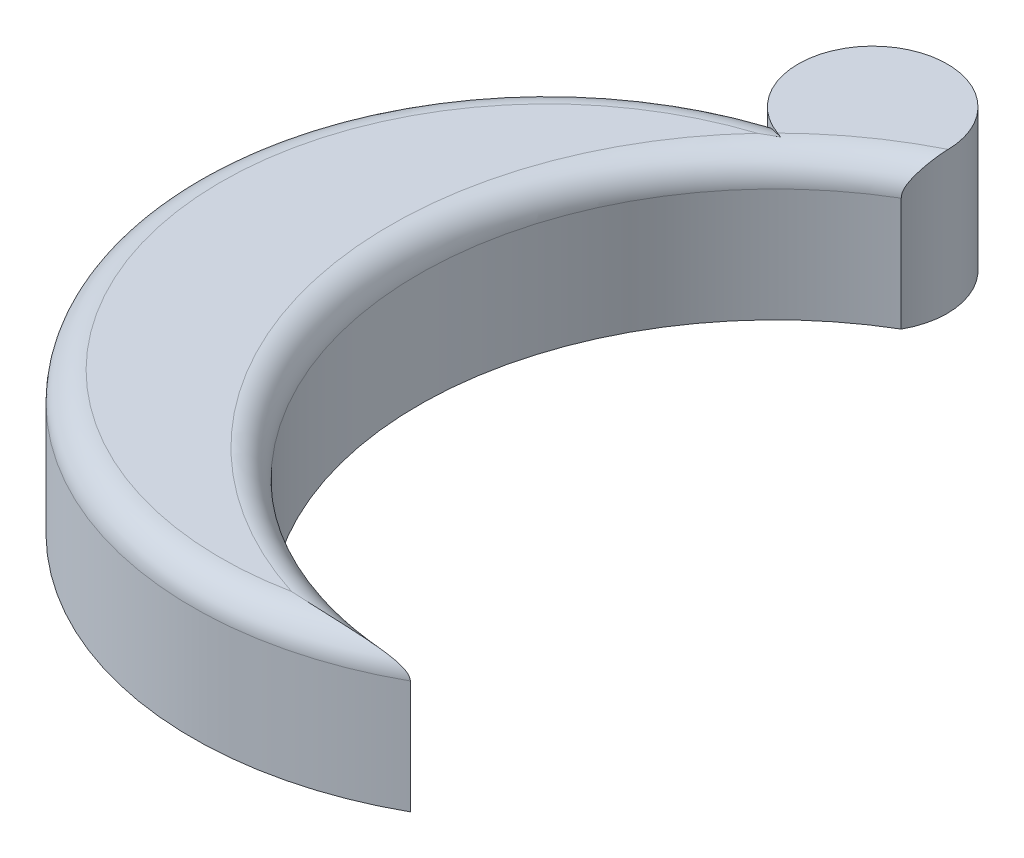
ISO-10303-21;
HEADER;
FILE_DESCRIPTION(('STEP AP214'),'2;1');
FILE_NAME('part.step','',(''),(''),'','','');
FILE_SCHEMA(('AUTOMOTIVE_DESIGN { 1 0 10303 214 1 1 1 1 }'));
ENDSEC;
DATA;
#1=APPLICATION_CONTEXT('core data for automotive mechanical design processes');
#2=APPLICATION_PROTOCOL_DEFINITION('international standard','automotive_design',2000,#1);
#3=PRODUCT_CONTEXT('',#1,'mechanical');
#4=PRODUCT('Part','Part','',(#3));
#5=PRODUCT_RELATED_PRODUCT_CATEGORY('part','',(#4));
#6=PRODUCT_DEFINITION_FORMATION('','',#4);
#7=PRODUCT_DEFINITION_CONTEXT('part definition',#1,'design');
#8=PRODUCT_DEFINITION('design','',#6,#7);
#9=PRODUCT_DEFINITION_SHAPE('','',#8);
#10=(LENGTH_UNIT() NAMED_UNIT(*) SI_UNIT(.MILLI.,.METRE.));
#11=(NAMED_UNIT(*) PLANE_ANGLE_UNIT() SI_UNIT($,.RADIAN.));
#12=(NAMED_UNIT(*) SI_UNIT($,.STERADIAN.) SOLID_ANGLE_UNIT());
#13=UNCERTAINTY_MEASURE_WITH_UNIT(LENGTH_MEASURE(1.E-05),#10,'distance_accuracy_value','');
#14=(GEOMETRIC_REPRESENTATION_CONTEXT(3) GLOBAL_UNCERTAINTY_ASSIGNED_CONTEXT((#13)) GLOBAL_UNIT_ASSIGNED_CONTEXT((#10,
#11,#12)) REPRESENTATION_CONTEXT('',''));
#15=CARTESIAN_POINT('',(0.,0.,0.));
#16=DIRECTION('',(0.,0.,1.));
#17=DIRECTION('',(1.,0.,0.));
#18=AXIS2_PLACEMENT_3D('',#15,#16,#17);
#19=CARTESIAN_POINT('',(-59.5639231366178,4.,-10.628423661122));
#20=DIRECTION('',(0.,1.,0.));
#21=DIRECTION('',(0.,0.,1.));
#22=AXIS2_PLACEMENT_3D('',#19,#20,#21);
#23=PLANE('',#22);
#24=CARTESIAN_POINT('',(-53.5339748169812,4.,-6.44449250465161));
#25=DIRECTION('',(0.,1.,0.));
#26=DIRECTION('',(0.,0.,1.));
#27=AXIS2_PLACEMENT_3D('',#24,#25,#26);
#28=CIRCLE('',#27,10.8650714686804);
#29=CARTESIAN_POINT('',(-56.8376783001658,4.,3.90612686400102));
#30=VERTEX_POINT('',#29);
#31=CARTESIAN_POINT('',(-61.4633027143419,4.,-13.8725162738429));
#32=VERTEX_POINT('',#31);
#33=EDGE_CURVE('E118',#30,#32,#28,.F.);
#34=ORIENTED_EDGE('',*,*,#33,.T.);
#35=CARTESIAN_POINT('',(-58.6468152214102,4.,-5.11424029039963));
#36=DIRECTION('',(0.,1.,0.));
#37=DIRECTION('',(0.,0.,1.));
#38=AXIS2_PLACEMENT_3D('',#35,#36,#37);
#39=CIRCLE('',#38,9.2);
#40=EDGE_CURVE('E120',#32,#30,#39,.T.);
#41=ORIENTED_EDGE('',*,*,#40,.T.);
#42=EDGE_LOOP('',(#34,#41));
#43=FACE_BOUND('',#42,.T.);
#44=ADVANCED_FACE('F33',(#43),#23,.T.);
#45=CARTESIAN_POINT('',(-60.4810310518254,4.,-16.1426070318443));
#46=DIRECTION('',(0.,-1.,0.));
#47=DIRECTION('',(0.,0.,-1.));
#48=AXIS2_PLACEMENT_3D('',#45,#46,#47);
#49=CYLINDRICAL_SURFACE('',#48,2.10282806416867);
#50=CARTESIAN_POINT('',(-60.4810310518254,4.,-16.1426070318443));
#51=DIRECTION('',(0.,1.,0.));
#52=DIRECTION('',(0.,0.,1.));
#53=AXIS2_PLACEMENT_3D('',#50,#51,#52);
#54=CIRCLE('',#53,2.10282806416867);
#55=CARTESIAN_POINT('',(-58.378378768013,4.,-16.1697960155329));
#56=VERTEX_POINT('',#55);
#57=CARTESIAN_POINT('',(-61.1833317311835,4.,-14.1605223658352));
#58=VERTEX_POINT('',#57);
#59=EDGE_CURVE('E112',#56,#58,#54,.T.);
#60=ORIENTED_EDGE('',*,*,#59,.F.);
#61=CARTESIAN_POINT('',(-58.378378768013,4.,-16.1697960155329));
#62=CARTESIAN_POINT('',(-58.3780014692178,3.9999999465474,-16.1408949912779));
#63=CARTESIAN_POINT('',(-58.3782279265322,3.99872907116534,-16.1120127621585));
#64=CARTESIAN_POINT('',(-58.3798530227261,3.99382547867741,-16.0545171315933));
#65=CARTESIAN_POINT('',(-58.3812501801303,3.99019574791303,-16.0259034365819));
#66=CARTESIAN_POINT('',(-58.3871072617975,3.97612464313053,-15.9412578059451));
#67=CARTESIAN_POINT('',(-58.3932270001599,3.96249397665374,-15.8858483272136));
#68=CARTESIAN_POINT('',(-58.4092954012554,3.92811462909885,-15.7782595235477));
#69=CARTESIAN_POINT('',(-58.4192250419721,3.90740136493314,-15.7260656229682));
#70=CARTESIAN_POINT('',(-58.4422186007069,3.85972695523316,-15.6250864497154));
#71=CARTESIAN_POINT('',(-58.4552969117372,3.83273713858387,-15.5763181983939));
#72=CARTESIAN_POINT('',(-58.486801596019,3.76666246275849,-15.4729593126887));
#73=CARTESIAN_POINT('',(-58.5057730795343,3.72622447708835,-15.4193807076192));
#74=CARTESIAN_POINT('',(-58.5350711222372,3.65930836951772,-15.3452123200485));
#75=CARTESIAN_POINT('',(-58.5449656820909,3.63598952112576,-15.3215459074425));
#76=CARTESIAN_POINT('',(-58.5646221024567,3.58706763558416,-15.276663382738));
#77=CARTESIAN_POINT('',(-58.5743841114159,3.56146744750969,-15.2554442882394));
#78=CARTESIAN_POINT('',(-58.5921041401446,3.51081742103074,-15.2183701209539));
#79=CARTESIAN_POINT('',(-58.6001404419344,3.4860437494528,-15.2021787278027));
#80=CARTESIAN_POINT('',(-58.6150230591244,3.43433514377018,-15.1729844620647));
#81=CARTESIAN_POINT('',(-58.6218709114637,3.40740306791058,-15.159977462242));
#82=CARTESIAN_POINT('',(-58.6324829985811,3.35644568642623,-15.1401804215299));
#83=CARTESIAN_POINT('',(-58.6365801131104,3.33276648099699,-15.1326935007621));
#84=CARTESIAN_POINT('',(-58.6428497906086,3.28433919131046,-15.1213230027719));
#85=CARTESIAN_POINT('',(-58.6450282573457,3.25959463343595,-15.1174283701514));
#86=CARTESIAN_POINT('',(-58.646574331111,3.2231403332427,-15.1146711571595));
#87=CARTESIAN_POINT('',(-58.6468232814476,3.21156973727964,-15.1142292507266));
#88=CARTESIAN_POINT('',(-58.6468152214097,3.19999999999995,-15.1142402904));
#89=B_SPLINE_CURVE_WITH_KNOTS('',3,(#61,#62,#63,#64,#65,#66,#67,#68,#69,#70,#71,#72,#73,#74,#75,
#76,#77,#78,#79,#80,#81,#82,#83,#84,#85,#86,#87,#88),.UNSPECIFIED.,.F.,.F.,(4,2,2,2,2,2,2,2,2,2,
2,2,2,4),(0.,0.0866318654363301,0.173154266909832,0.344504043866102,0.515009212708246,
0.686309098651315,0.894546003736132,0.998431209360771,1.10218844790077,1.19399622914687,
1.28568438241805,1.36091305819536,1.43590943487363,1.47061460501447),.UNSPECIFIED.);
#90=CARTESIAN_POINT('',(-58.6468152214102,3.2,-15.1142402903996));
#91=VERTEX_POINT('',#90);
#92=EDGE_CURVE('E58',#56,#91,#89,.T.);
#93=ORIENTED_EDGE('',*,*,#92,.T.);
#94=DIRECTION('',(0.,-1.,0.));
#95=VECTOR('',#94,1.);
#96=CARTESIAN_POINT('',(-58.6468152214102,4.,-15.1142402903996));
#97=LINE('',#96,#95);
#98=CARTESIAN_POINT('',(-58.6468152214102,0.,-15.1142402903996));
#99=VERTEX_POINT('',#98);
#100=EDGE_CURVE('E107',#91,#99,#97,.T.);
#101=ORIENTED_EDGE('',*,*,#100,.T.);
#102=CARTESIAN_POINT('',(-60.4810310518254,0.,-16.1426070318443));
#103=DIRECTION('',(0.,1.,0.));
#104=DIRECTION('',(0.,0.,1.));
#105=AXIS2_PLACEMENT_3D('',#102,#103,#104);
#106=CIRCLE('',#105,2.10282806416867);
#107=CARTESIAN_POINT('',(-61.8836391247971,0.,-14.5758982327723));
#108=VERTEX_POINT('',#107);
#109=EDGE_CURVE('E102',#99,#108,#106,.T.);
#110=ORIENTED_EDGE('',*,*,#109,.T.);
#111=DIRECTION('',(0.,-1.,0.));
#112=VECTOR('',#111,1.);
#113=CARTESIAN_POINT('',(-61.8836391247971,4.,-14.5758982327723));
#114=LINE('',#113,#112);
#115=CARTESIAN_POINT('',(-61.8836391247971,3.2,-14.5758982327723));
#116=VERTEX_POINT('',#115);
#117=EDGE_CURVE('E87',#116,#108,#114,.T.);
#118=ORIENTED_EDGE('',*,*,#117,.F.);
#119=CARTESIAN_POINT('',(-61.8836391247971,3.2,-14.5758982327723));
#120=CARTESIAN_POINT('',(-61.8836380336328,3.2198477107302,-14.5758994830421));
#121=CARTESIAN_POINT('',(-61.8830079142397,3.23968574500682,-14.5753328917651));
#122=CARTESIAN_POINT('',(-61.8804879895834,3.27921593865092,-14.5730815076007));
#123=CARTESIAN_POINT('',(-61.8785983033803,3.29890811162803,-14.5713968204011));
#124=CARTESIAN_POINT('',(-61.8710509297953,3.35747575280989,-14.5647037804302));
#125=CARTESIAN_POINT('',(-61.863514921307,3.3959512308473,-14.5580562510677));
#126=CARTESIAN_POINT('',(-61.8434938015639,3.47065289103075,-14.5408101345133));
#127=CARTESIAN_POINT('',(-61.8310069825081,3.50687829201126,-14.5302101839939));
#128=CARTESIAN_POINT('',(-61.8012449132364,3.5761104998783,-14.5057532053822));
#129=CARTESIAN_POINT('',(-61.7839703544436,3.60911777058252,-14.4918966476379));
#130=CARTESIAN_POINT('',(-61.7446881333484,3.67153939074129,-14.4616321817612));
#131=CARTESIAN_POINT('',(-61.7226235550313,3.70090320710053,-14.4451943155059));
#132=CARTESIAN_POINT('',(-61.6743725091505,3.75507095938237,-14.4109323946935));
#133=CARTESIAN_POINT('',(-61.6481845745995,3.77987326559857,-14.3931078479364));
#134=CARTESIAN_POINT('',(-61.5901480619117,3.82651214242733,-14.3557038203932));
#135=CARTESIAN_POINT('',(-61.5580190218441,3.84797387849214,-14.3360948069052));
#136=CARTESIAN_POINT('',(-61.4905332510234,3.88571871992816,-14.2975302533525));
#137=CARTESIAN_POINT('',(-61.455175667903,3.9020004526098,-14.2785748876877));
#138=CARTESIAN_POINT('',(-61.3605192034142,3.93817162220508,-14.231437873721));
#139=CARTESIAN_POINT('',(-61.2993390840577,3.95457815986157,-14.2043638007371));
#140=CARTESIAN_POINT('',(-61.173089533776,3.97884743219694,-14.1557595938738));
#141=CARTESIAN_POINT('',(-61.1080055137544,3.98667570177376,-14.134252087121));
#142=CARTESIAN_POINT('',(-60.999784188693,3.99491082314488,-14.104300582415));
#143=CARTESIAN_POINT('',(-60.9572678967367,3.99698092152153,-14.0939497274201));
#144=CARTESIAN_POINT('',(-60.8719556961113,3.99951273730585,-14.0759788668333));
#145=CARTESIAN_POINT('',(-60.8291645158659,3.99998680835641,-14.0683382976168));
#146=CARTESIAN_POINT('',(-60.7861865479594,4.,-14.0620383618326));
#147=B_SPLINE_CURVE_WITH_KNOTS('',3,(#119,#120,#121,#122,#123,#124,#125,#126,#127,#128,#129,
#130,#131,#132,#133,#134,#135,#136,#137,#138,#139,#140,#141,#142,#143,#144,#145,#146),
.UNSPECIFIED.,.F.,.F.,(4,2,2,2,2,2,2,2,2,2,2,2,2,4),(0.,0.0595058836483715,0.11900614332322,
0.237684241601731,0.356403314011511,0.475105250490446,0.595303422972101,0.715544455997459,
0.845033767846667,0.974557365553562,1.18003142368057,1.38632802667977,1.51764438644049,
1.64794195927347),.UNSPECIFIED.);
#148=CARTESIAN_POINT('',(-61.0531795843405,3.99081887739846,-14.1191120542879));
#149=VERTEX_POINT('',#148);
#150=EDGE_CURVE('E45',#116,#149,#147,.T.);
#151=ORIENTED_EDGE('',*,*,#150,.T.);
#152=CARTESIAN_POINT('',(-61.0531795843405,3.99081887739846,-14.1191120542879));
#153=CARTESIAN_POINT('',(-61.0749995938432,3.99385042284317,-14.1252785198327));
#154=CARTESIAN_POINT('',(-61.0967555923204,3.99613128909091,-14.1318126053449));
#155=CARTESIAN_POINT('',(-61.1401396417077,3.99919166844667,-14.1456160400028));
#156=CARTESIAN_POINT('',(-61.1617676921782,3.99997117639944,-14.152885391673));
#157=CARTESIAN_POINT('',(-61.1833317311835,4.,-14.1605223658352));
#158=B_SPLINE_CURVE_WITH_KNOTS('',3,(#152,#153,#154,#155,#156,#157),.UNSPECIFIED.,.F.,.F.,(4,2,
4),(0.,0.0684907354796218,0.136981706136938),.UNSPECIFIED.);
#159=EDGE_CURVE('E11',#149,#58,#158,.T.);
#160=ORIENTED_EDGE('',*,*,#159,.T.);
#161=EDGE_LOOP('',(#60,#93,#101,#110,#118,#151,#160));
#162=FACE_BOUND('',#161,.T.);
#163=ADVANCED_FACE('F106',(#162),#49,.T.);
#164=CARTESIAN_POINT('',(-58.6468152214102,4.,-5.11424029039963));
#165=DIRECTION('',(0.,-1.,0.));
#166=DIRECTION('',(0.,0.,-1.));
#167=AXIS2_PLACEMENT_3D('',#164,#165,#166);
#168=CYLINDRICAL_SURFACE('',#167,10.);
#169=DIRECTION('',(0.,-1.,0.));
#170=VECTOR('',#169,1.);
#171=CARTESIAN_POINT('',(-53.7731536287688,4.,3.61773672974949));
#172=LINE('',#171,#170);
#173=CARTESIAN_POINT('',(-53.7731536287688,3.2,3.61773672974949));
#174=VERTEX_POINT('',#173);
#175=CARTESIAN_POINT('',(-53.7731536287688,0.,3.61773672974949));
#176=VERTEX_POINT('',#175);
#177=EDGE_CURVE('E97',#174,#176,#172,.T.);
#178=ORIENTED_EDGE('',*,*,#177,.F.);
#179=CARTESIAN_POINT('',(-58.6468152214102,3.2,-5.11424029039963));
#180=DIRECTION('',(0.,1.,0.));
#181=DIRECTION('',(0.,0.,1.));
#182=AXIS2_PLACEMENT_3D('',#179,#180,#181);
#183=CIRCLE('',#182,10.);
#184=EDGE_CURVE('E94',#174,#116,#183,.F.);
#185=ORIENTED_EDGE('',*,*,#184,.T.);
#186=ORIENTED_EDGE('',*,*,#117,.T.);
#187=CARTESIAN_POINT('',(-58.6468152214102,0.,-5.11424029039963));
#188=DIRECTION('',(0.,1.,0.));
#189=DIRECTION('',(0.,0.,1.));
#190=AXIS2_PLACEMENT_3D('',#187,#188,#189);
#191=CIRCLE('',#190,10.);
#192=EDGE_CURVE('E91',#108,#176,#191,.T.);
#193=ORIENTED_EDGE('',*,*,#192,.T.);
#194=EDGE_LOOP('',(#178,#185,#186,#193));
#195=FACE_BOUND('',#194,.T.);
#196=ADVANCED_FACE('F90',(#195),#168,.T.);
#197=CARTESIAN_POINT('',(-53.5339748169812,4.,-6.44449250465161));
#198=DIRECTION('',(0.,-1.,0.));
#199=DIRECTION('',(0.,0.,-1.));
#200=AXIS2_PLACEMENT_3D('',#197,#198,#199);
#201=CYLINDRICAL_SURFACE('',#200,10.0650714686804);
#202=ORIENTED_EDGE('',*,*,#100,.F.);
#203=CARTESIAN_POINT('',(-53.5339748169812,3.2,-6.44449250465161));
#204=DIRECTION('',(0.,1.,0.));
#205=DIRECTION('',(0.,0.,1.));
#206=AXIS2_PLACEMENT_3D('',#203,#204,#205);
#207=CIRCLE('',#206,10.0650714686804);
#208=EDGE_CURVE('E124',#91,#174,#207,.T.);
#209=ORIENTED_EDGE('',*,*,#208,.T.);
#210=ORIENTED_EDGE('',*,*,#177,.T.);
#211=CARTESIAN_POINT('',(-53.5339748169812,0.,-6.44449250465161));
#212=DIRECTION('',(0.,1.,0.));
#213=DIRECTION('',(0.,0.,1.));
#214=AXIS2_PLACEMENT_3D('',#211,#212,#213);
#215=CIRCLE('',#214,10.0650714686804);
#216=EDGE_CURVE('E104',#99,#176,#215,.T.);
#217=ORIENTED_EDGE('',*,*,#216,.F.);
#218=EDGE_LOOP('',(#202,#209,#210,#217));
#219=FACE_BOUND('',#218,.T.);
#220=ADVANCED_FACE('F168',(#219),#201,.F.);
#221=ORIENTED_EDGE('',*,*,#59,.T.);
#222=CARTESIAN_POINT('',(-53.5339748169812,4.,-6.44449250465161));
#223=DIRECTION('',(0.,1.,0.));
#224=DIRECTION('',(0.,0.,1.));
#225=AXIS2_PLACEMENT_3D('',#222,#223,#224);
#226=CIRCLE('',#225,10.8650714686804);
#227=EDGE_CURVE('E96',#58,#56,#226,.F.);
#228=ORIENTED_EDGE('',*,*,#227,.T.);
#229=EDGE_LOOP('',(#221,#228));
#230=FACE_BOUND('',#229,.T.);
#231=ADVANCED_FACE('F163',(#230),#23,.T.);
#232=CARTESIAN_POINT('',(-59.5639231366178,0.,-10.628423661122));
#233=DIRECTION('',(0.,1.,0.));
#234=DIRECTION('',(0.,0.,1.));
#235=AXIS2_PLACEMENT_3D('',#232,#233,#234);
#236=PLANE('',#235);
#237=ORIENTED_EDGE('',*,*,#109,.F.);
#238=ORIENTED_EDGE('',*,*,#216,.T.);
#239=ORIENTED_EDGE('',*,*,#192,.F.);
#240=EDGE_LOOP('',(#237,#238,#239));
#241=FACE_BOUND('',#240,.T.);
#242=ADVANCED_FACE('F101',(#241),#236,.F.);
#243=CARTESIAN_POINT('',(-53.5339748169812,3.2,-6.44449250465161));
#244=DIRECTION('',(0.,1.,0.));
#245=DIRECTION('',(0.,0.,1.));
#246=AXIS2_PLACEMENT_3D('',#243,#244,#245);
#247=TOROIDAL_SURFACE('',#246,10.8650714686804,0.8);
#248=ORIENTED_EDGE('',*,*,#227,.F.);
#249=ORIENTED_EDGE('',*,*,#159,.F.);
#250=CARTESIAN_POINT('',(-61.0531795843405,3.99081887739846,-14.1191120542879));
#251=CARTESIAN_POINT('',(-61.1212789013979,3.99386052486318,-14.0802890210329));
#252=CARTESIAN_POINT('',(-61.1889639515134,3.99613048911751,-14.0406725958005));
#253=CARTESIAN_POINT('',(-61.3234071564085,3.99917360054833,-13.9599080861251));
#254=CARTESIAN_POINT('',(-61.3901657110584,3.99994741474787,-13.9187606925716));
#255=CARTESIAN_POINT('',(-61.4587295234258,3.99999913468872,-13.8754114486008));
#256=CARTESIAN_POINT('',(-61.4610164067869,3.99999999797086,-13.8739643108883));
#257=CARTESIAN_POINT('',(-61.4633027143418,4.,-13.8725162738429));
#258=B_SPLINE_CURVE_WITH_KNOTS('',3,(#250,#251,#252,#253,#254,#255,#256,#257),.UNSPECIFIED.,.F.,
.F.,(4,2,2,4),(0.,0.235340067207382,0.470575189407295,0.478694079012972),.UNSPECIFIED.);
#259=EDGE_CURVE('E37',#32,#149,#258,.F.);
#260=ORIENTED_EDGE('',*,*,#259,.F.);
#261=ORIENTED_EDGE('',*,*,#33,.F.);
#262=CARTESIAN_POINT('',(-53.7731536287688,3.2,3.61773672974949));
#263=CARTESIAN_POINT('',(-53.7731026361103,3.21448893242615,3.61772315813247));
#264=CARTESIAN_POINT('',(-53.7746023461875,3.22889683503537,3.61809540582863));
#265=CARTESIAN_POINT('',(-53.7801998636364,3.25693693674744,3.61947891019025));
#266=CARTESIAN_POINT('',(-53.7842553660653,3.27057790021873,3.62047976095977));
#267=CARTESIAN_POINT('',(-53.7957247455853,3.30014731177818,3.62329896564934));
#268=CARTESIAN_POINT('',(-53.8037130342511,3.31583295323665,3.6252563484818));
#269=CARTESIAN_POINT('',(-53.8220246469278,3.34577759342989,3.62971286794425));
#270=CARTESIAN_POINT('',(-53.8323632997691,3.36002629816069,3.63221555633508));
#271=CARTESIAN_POINT('',(-53.8634018086059,3.39785250428246,3.6396690442483));
#272=CARTESIAN_POINT('',(-53.8858360915318,3.41991029415985,3.64499228419717));
#273=CARTESIAN_POINT('',(-53.9333722442516,3.46069517258436,3.65608138483901));
#274=CARTESIAN_POINT('',(-53.9584792974478,3.4794155937421,3.66184809934057));
#275=CARTESIAN_POINT('',(-54.0245388448213,3.5240169069955,3.67674286181592));
#276=CARTESIAN_POINT('',(-54.066615883118,3.54817819256513,3.68597633562289));
#277=CARTESIAN_POINT('',(-54.1528576800591,3.5925611359383,3.70430931447526));
#278=CARTESIAN_POINT('',(-54.1970270414967,3.61277355424604,3.7134084603448));
#279=CARTESIAN_POINT('',(-54.2868993910214,3.65037313411521,3.7312957972531));
#280=CARTESIAN_POINT('',(-54.3326094993744,3.66774408290705,3.74008199436794));
#281=CARTESIAN_POINT('',(-54.4248639989662,3.70017183769944,3.75716082390429));
#282=CARTESIAN_POINT('',(-54.4714074643933,3.71523105297684,3.76545396458539));
#283=CARTESIAN_POINT('',(-54.5927155695238,3.75181954540883,3.78620385061271));
#284=CARTESIAN_POINT('',(-54.6679753668205,3.77194371647723,3.79824006507276));
#285=CARTESIAN_POINT('',(-54.8195972115991,3.80864340704644,3.820758345202));
#286=CARTESIAN_POINT('',(-54.8959597145301,3.82521741272078,3.83123974730006));
#287=CARTESIAN_POINT('',(-55.0495851351746,3.85549277944813,3.85057129212634));
#288=CARTESIAN_POINT('',(-55.1268493256682,3.86918937809936,3.85941872759303));
#289=CARTESIAN_POINT('',(-55.2819535045228,3.89411706021176,3.87540521358755));
#290=CARTESIAN_POINT('',(-55.3597935684926,3.90534781376243,3.88254403552796));
#291=CARTESIAN_POINT('',(-55.5936431122394,3.93578053143981,3.90131317128003));
#292=CARTESIAN_POINT('',(-55.7502900480177,3.95178060424777,3.91033509768993));
#293=CARTESIAN_POINT('',(-56.0642126002608,3.97674004624308,3.92122648581297));
#294=CARTESIAN_POINT('',(-56.2214874422534,3.98570635920751,3.92310300859178));
#295=CARTESIAN_POINT('',(-56.4539756650154,3.99435359268098,3.92055514185541));
#296=CARTESIAN_POINT('',(-56.5291472048277,3.99643828936906,3.91890972358684));
#297=CARTESIAN_POINT('',(-56.6794195198209,3.9992357979945,3.91397426146246));
#298=CARTESIAN_POINT('',(-56.7545203099346,3.99994946243857,3.91068524120148));
#299=CARTESIAN_POINT('',(-56.8322739913122,3.99999913551648,3.90642610525303));
#300=CARTESIAN_POINT('',(-56.8349761786059,3.99999999882903,3.90627701750226));
#301=CARTESIAN_POINT('',(-56.8376783001658,4.,3.90612686400103));
#302=B_SPLINE_CURVE_WITH_KNOTS('',3,(#262,#263,#264,#265,#266,#267,#268,#269,#270,#271,#272,
#273,#274,#275,#276,#277,#278,#279,#280,#281,#282,#283,#284,#285,#286,#287,#288,#289,#290,#291,
#292,#293,#294,#295,#296,#297,#298,#299,#300,#301),.UNSPECIFIED.,.F.,.F.,(4,2,2,2,2,2,2,2,2,2,2,
2,2,2,2,2,2,2,2,4),(0.,0.0432551529465197,0.0858124786178803,0.13864405803721,0.191830621351527,
0.28702183570343,0.382401142247712,0.530203104715928,0.678346855586865,0.827308431491299,
0.976113690714337,1.21245441511722,1.44889571785802,1.6857253245108,1.92258659780222,
2.395363834879,2.86767375352894,3.09330544125891,3.31879678592468,3.32691567552733),.UNSPECIFIED.);
#303=EDGE_CURVE('E110',#174,#30,#302,.T.);
#304=ORIENTED_EDGE('',*,*,#303,.F.);
#305=ORIENTED_EDGE('',*,*,#208,.F.);
#306=ORIENTED_EDGE('',*,*,#92,.F.);
#307=EDGE_LOOP('',(#248,#249,#260,#261,#304,#305,#306));
#308=FACE_BOUND('',#307,.T.);
#309=ADVANCED_FACE('F135',(#308),#247,.T.);
#310=CARTESIAN_POINT('',(-58.6468152214102,3.2,-5.11424029039963));
#311=DIRECTION('',(0.,1.,0.));
#312=DIRECTION('',(0.,0.,1.));
#313=AXIS2_PLACEMENT_3D('',#310,#311,#312);
#314=TOROIDAL_SURFACE('',#313,9.2,0.8);
#315=ORIENTED_EDGE('',*,*,#150,.F.);
#316=ORIENTED_EDGE('',*,*,#184,.F.);
#317=ORIENTED_EDGE('',*,*,#303,.T.);
#318=ORIENTED_EDGE('',*,*,#40,.F.);
#319=ORIENTED_EDGE('',*,*,#259,.T.);
#320=EDGE_LOOP('',(#315,#316,#317,#318,#319));
#321=FACE_BOUND('',#320,.T.);
#322=ADVANCED_FACE('F144',(#321),#314,.T.);
#323=CLOSED_SHELL('',(#44,#163,#196,#220,#231,#242,#309,#322));
#324=MANIFOLD_SOLID_BREP('B2',#323);
#325=ADVANCED_BREP_SHAPE_REPRESENTATION('',(#18,#324),#14);
#326=SHAPE_DEFINITION_REPRESENTATION(#9,#325);
ENDSEC;
END-ISO-10303-21;
